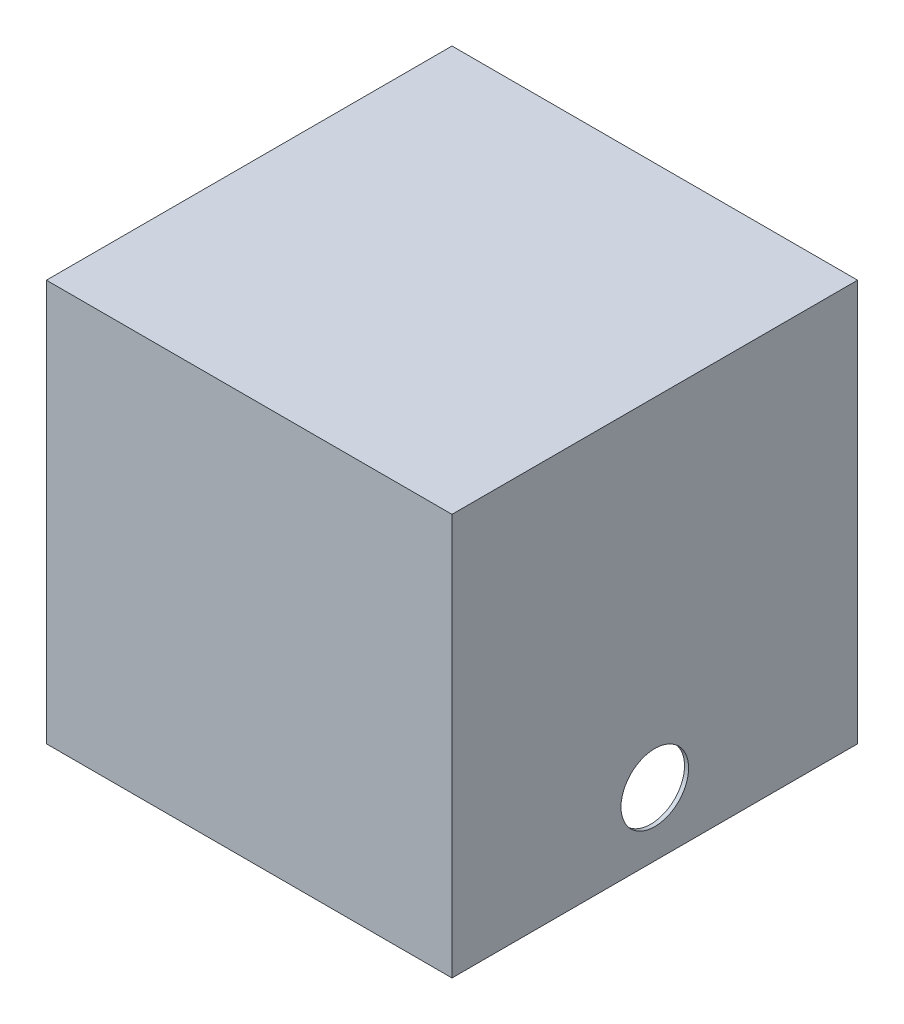
ISO-10303-21;
HEADER;
FILE_DESCRIPTION(('STEP AP214'),'2;1');
FILE_NAME('part.step','',(''),(''),'','','');
FILE_SCHEMA(('AUTOMOTIVE_DESIGN { 1 0 10303 214 1 1 1 1 }'));
ENDSEC;
DATA;
#1=APPLICATION_CONTEXT('core data for automotive mechanical design processes');
#2=APPLICATION_PROTOCOL_DEFINITION('international standard','automotive_design',2000,#1);
#3=PRODUCT_CONTEXT('',#1,'mechanical');
#4=PRODUCT('Part','Part','',(#3));
#5=PRODUCT_RELATED_PRODUCT_CATEGORY('part','',(#4));
#6=PRODUCT_DEFINITION_FORMATION('','',#4);
#7=PRODUCT_DEFINITION_CONTEXT('part definition',#1,'design');
#8=PRODUCT_DEFINITION('design','',#6,#7);
#9=PRODUCT_DEFINITION_SHAPE('','',#8);
#10=(LENGTH_UNIT() NAMED_UNIT(*) SI_UNIT(.MILLI.,.METRE.));
#11=(NAMED_UNIT(*) PLANE_ANGLE_UNIT() SI_UNIT($,.RADIAN.));
#12=(NAMED_UNIT(*) SI_UNIT($,.STERADIAN.) SOLID_ANGLE_UNIT());
#13=UNCERTAINTY_MEASURE_WITH_UNIT(LENGTH_MEASURE(1.E-05),#10,'distance_accuracy_value','');
#14=(GEOMETRIC_REPRESENTATION_CONTEXT(3) GLOBAL_UNCERTAINTY_ASSIGNED_CONTEXT((#13)) GLOBAL_UNIT_ASSIGNED_CONTEXT((#10,
#11,#12)) REPRESENTATION_CONTEXT('',''));
#15=CARTESIAN_POINT('',(0.,0.,0.));
#16=DIRECTION('',(0.,0.,1.));
#17=DIRECTION('',(1.,0.,0.));
#18=AXIS2_PLACEMENT_3D('',#15,#16,#17);
#19=CARTESIAN_POINT('',(0.,297.,0.));
#20=DIRECTION('',(0.,-1.,0.));
#21=DIRECTION('',(0.,0.,-1.));
#22=AXIS2_PLACEMENT_3D('',#19,#20,#21);
#23=PLANE('',#22);
#24=DIRECTION('',(-1.,0.,0.));
#25=VECTOR('',#24,1.);
#26=CARTESIAN_POINT('',(147.,297.,147.));
#27=LINE('',#26,#25);
#28=CARTESIAN_POINT('',(147.,297.,147.));
#29=VERTEX_POINT('',#28);
#30=CARTESIAN_POINT('',(-147.,297.,147.));
#31=VERTEX_POINT('',#30);
#32=EDGE_CURVE('E159',#29,#31,#27,.T.);
#33=ORIENTED_EDGE('',*,*,#32,.T.);
#34=DIRECTION('',(0.,0.,-1.));
#35=VECTOR('',#34,1.);
#36=CARTESIAN_POINT('',(-147.,297.,-147.));
#37=LINE('',#36,#35);
#38=CARTESIAN_POINT('',(-147.,297.,-147.));
#39=VERTEX_POINT('',#38);
#40=EDGE_CURVE('E65',#31,#39,#37,.T.);
#41=ORIENTED_EDGE('',*,*,#40,.T.);
#42=DIRECTION('',(1.,0.,0.));
#43=VECTOR('',#42,1.);
#44=CARTESIAN_POINT('',(147.,297.,-147.));
#45=LINE('',#44,#43);
#46=CARTESIAN_POINT('',(147.,297.,-147.));
#47=VERTEX_POINT('',#46);
#48=EDGE_CURVE('E11',#39,#47,#45,.T.);
#49=ORIENTED_EDGE('',*,*,#48,.T.);
#50=DIRECTION('',(0.,0.,1.));
#51=VECTOR('',#50,1.);
#52=CARTESIAN_POINT('',(147.,297.,-147.));
#53=LINE('',#52,#51);
#54=EDGE_CURVE('E156',#47,#29,#53,.T.);
#55=ORIENTED_EDGE('',*,*,#54,.T.);
#56=EDGE_LOOP('',(#33,#41,#49,#55));
#57=FACE_BOUND('',#56,.T.);
#58=ADVANCED_FACE('F41',(#57),#23,.T.);
#59=CARTESIAN_POINT('',(147.,300.,-147.));
#60=DIRECTION('',(0.,0.,1.));
#61=DIRECTION('',(1.,0.,0.));
#62=AXIS2_PLACEMENT_3D('',#59,#60,#61);
#63=PLANE('',#62);
#64=ORIENTED_EDGE('',*,*,#48,.F.);
#65=DIRECTION('',(0.,-1.,0.));
#66=VECTOR('',#65,1.);
#67=CARTESIAN_POINT('',(-147.,300.,-147.));
#68=LINE('',#67,#66);
#69=CARTESIAN_POINT('',(-147.,3.,-147.));
#70=VERTEX_POINT('',#69);
#71=EDGE_CURVE('E171',#39,#70,#68,.T.);
#72=ORIENTED_EDGE('',*,*,#71,.T.);
#73=DIRECTION('',(-1.,0.,0.));
#74=VECTOR('',#73,1.);
#75=CARTESIAN_POINT('',(147.,3.,-147.));
#76=LINE('',#75,#74);
#77=CARTESIAN_POINT('',(147.,3.,-147.));
#78=VERTEX_POINT('',#77);
#79=EDGE_CURVE('E169',#78,#70,#76,.T.);
#80=ORIENTED_EDGE('',*,*,#79,.F.);
#81=DIRECTION('',(0.,-1.,0.));
#82=VECTOR('',#81,1.);
#83=CARTESIAN_POINT('',(147.,300.,-147.));
#84=LINE('',#83,#82);
#85=EDGE_CURVE('E174',#47,#78,#84,.T.);
#86=ORIENTED_EDGE('',*,*,#85,.F.);
#87=EDGE_LOOP('',(#64,#72,#80,#86));
#88=FACE_BOUND('',#87,.T.);
#89=ADVANCED_FACE('F198',(#88),#63,.T.);
#90=CARTESIAN_POINT('',(147.,300.,-147.));
#91=DIRECTION('',(-1.,0.,0.));
#92=DIRECTION('',(0.,0.,1.));
#93=AXIS2_PLACEMENT_3D('',#90,#91,#92);
#94=PLANE('',#93);
#95=CARTESIAN_POINT('',(147.,50.,0.));
#96=DIRECTION('',(-1.,0.,0.));
#97=DIRECTION('',(0.,0.,1.));
#98=AXIS2_PLACEMENT_3D('',#95,#96,#97);
#99=CIRCLE('',#98,25.);
#100=CARTESIAN_POINT('',(147.,50.,25.));
#101=VERTEX_POINT('',#100);
#102=EDGE_CURVE('E150',#101,#101,#99,.T.);
#103=ORIENTED_EDGE('',*,*,#102,.F.);
#104=EDGE_LOOP('',(#103));
#105=FACE_BOUND('',#104,.T.);
#106=ORIENTED_EDGE('',*,*,#54,.F.);
#107=ORIENTED_EDGE('',*,*,#85,.T.);
#108=DIRECTION('',(0.,0.,-1.));
#109=VECTOR('',#108,1.);
#110=CARTESIAN_POINT('',(147.,3.,-147.));
#111=LINE('',#110,#109);
#112=CARTESIAN_POINT('',(147.,3.,147.));
#113=VERTEX_POINT('',#112);
#114=EDGE_CURVE('E167',#113,#78,#111,.T.);
#115=ORIENTED_EDGE('',*,*,#114,.F.);
#116=DIRECTION('',(0.,-1.,0.));
#117=VECTOR('',#116,1.);
#118=CARTESIAN_POINT('',(147.,300.,147.));
#119=LINE('',#118,#117);
#120=EDGE_CURVE('E177',#29,#113,#119,.T.);
#121=ORIENTED_EDGE('',*,*,#120,.F.);
#122=EDGE_LOOP('',(#106,#107,#115,#121));
#123=FACE_BOUND('',#122,.T.);
#124=ADVANCED_FACE('F205',(#105,#123),#94,.T.);
#125=CARTESIAN_POINT('',(147.,300.,147.));
#126=DIRECTION('',(0.,0.,-1.));
#127=DIRECTION('',(-1.,0.,0.));
#128=AXIS2_PLACEMENT_3D('',#125,#126,#127);
#129=PLANE('',#128);
#130=ORIENTED_EDGE('',*,*,#32,.F.);
#131=ORIENTED_EDGE('',*,*,#120,.T.);
#132=DIRECTION('',(1.,0.,0.));
#133=VECTOR('',#132,1.);
#134=CARTESIAN_POINT('',(147.,3.,147.));
#135=LINE('',#134,#133);
#136=CARTESIAN_POINT('',(-147.,3.,147.));
#137=VERTEX_POINT('',#136);
#138=EDGE_CURVE('E165',#137,#113,#135,.T.);
#139=ORIENTED_EDGE('',*,*,#138,.F.);
#140=DIRECTION('',(0.,-1.,0.));
#141=VECTOR('',#140,1.);
#142=CARTESIAN_POINT('',(-147.,300.,147.));
#143=LINE('',#142,#141);
#144=EDGE_CURVE('E180',#31,#137,#143,.T.);
#145=ORIENTED_EDGE('',*,*,#144,.F.);
#146=EDGE_LOOP('',(#130,#131,#139,#145));
#147=FACE_BOUND('',#146,.T.);
#148=ADVANCED_FACE('F213',(#147),#129,.T.);
#149=CARTESIAN_POINT('',(-147.,300.,-147.));
#150=DIRECTION('',(1.,0.,0.));
#151=DIRECTION('',(0.,0.,-1.));
#152=AXIS2_PLACEMENT_3D('',#149,#150,#151);
#153=PLANE('',#152);
#154=CARTESIAN_POINT('',(-147.,50.,0.));
#155=DIRECTION('',(1.,0.,0.));
#156=DIRECTION('',(0.,0.,-1.));
#157=AXIS2_PLACEMENT_3D('',#154,#155,#156);
#158=CIRCLE('',#157,25.);
#159=CARTESIAN_POINT('',(-147.,50.,-25.));
#160=VERTEX_POINT('',#159);
#161=EDGE_CURVE('E45',#160,#160,#158,.T.);
#162=ORIENTED_EDGE('',*,*,#161,.F.);
#163=EDGE_LOOP('',(#162));
#164=FACE_BOUND('',#163,.T.);
#165=ORIENTED_EDGE('',*,*,#40,.F.);
#166=ORIENTED_EDGE('',*,*,#144,.T.);
#167=DIRECTION('',(0.,0.,1.));
#168=VECTOR('',#167,1.);
#169=CARTESIAN_POINT('',(-147.,3.,-147.));
#170=LINE('',#169,#168);
#171=EDGE_CURVE('E163',#70,#137,#170,.T.);
#172=ORIENTED_EDGE('',*,*,#171,.F.);
#173=ORIENTED_EDGE('',*,*,#71,.F.);
#174=EDGE_LOOP('',(#165,#166,#172,#173));
#175=FACE_BOUND('',#174,.T.);
#176=ADVANCED_FACE('F216',(#164,#175),#153,.T.);
#177=CARTESIAN_POINT('',(-150.,50.,0.));
#178=DIRECTION('',(1.,0.,0.));
#179=DIRECTION('',(0.,0.,-1.));
#180=AXIS2_PLACEMENT_3D('',#177,#178,#179);
#181=CYLINDRICAL_SURFACE('',#180,25.);
#182=ORIENTED_EDGE('',*,*,#161,.T.);
#183=EDGE_LOOP('',(#182));
#184=FACE_BOUND('',#183,.T.);
#185=CARTESIAN_POINT('',(-150.,50.,0.));
#186=DIRECTION('',(1.,0.,0.));
#187=DIRECTION('',(0.,0.,-1.));
#188=AXIS2_PLACEMENT_3D('',#185,#186,#187);
#189=CIRCLE('',#188,25.);
#190=CARTESIAN_POINT('',(-150.,50.,-25.));
#191=VERTEX_POINT('',#190);
#192=EDGE_CURVE('E147',#191,#191,#189,.T.);
#193=ORIENTED_EDGE('',*,*,#192,.F.);
#194=EDGE_LOOP('',(#193));
#195=FACE_BOUND('',#194,.T.);
#196=ADVANCED_FACE('F209',(#184,#195),#181,.F.);
#197=ORIENTED_EDGE('',*,*,#102,.T.);
#198=EDGE_LOOP('',(#197));
#199=FACE_BOUND('',#198,.T.);
#200=CARTESIAN_POINT('',(150.,50.,0.));
#201=DIRECTION('',(-1.,0.,0.));
#202=DIRECTION('',(0.,0.,1.));
#203=AXIS2_PLACEMENT_3D('',#200,#201,#202);
#204=CIRCLE('',#203,25.);
#205=CARTESIAN_POINT('',(150.,50.,25.));
#206=VERTEX_POINT('',#205);
#207=EDGE_CURVE('E153',#206,#206,#204,.T.);
#208=ORIENTED_EDGE('',*,*,#207,.F.);
#209=EDGE_LOOP('',(#208));
#210=FACE_BOUND('',#209,.T.);
#211=ADVANCED_FACE('F223',(#199,#210),#181,.F.);
#212=CARTESIAN_POINT('',(-150.,3.,-150.));
#213=DIRECTION('',(1.,0.,0.));
#214=DIRECTION('',(0.,0.,-1.));
#215=AXIS2_PLACEMENT_3D('',#212,#213,#214);
#216=PLANE('',#215);
#217=ORIENTED_EDGE('',*,*,#192,.T.);
#218=EDGE_LOOP('',(#217));
#219=FACE_BOUND('',#218,.T.);
#220=DIRECTION('',(0.,-1.,0.));
#221=VECTOR('',#220,1.);
#222=CARTESIAN_POINT('',(-150.,3.,-150.));
#223=LINE('',#222,#221);
#224=CARTESIAN_POINT('',(-150.,300.,-150.));
#225=VERTEX_POINT('',#224);
#226=CARTESIAN_POINT('',(-150.,3.,-150.));
#227=VERTEX_POINT('',#226);
#228=EDGE_CURVE('E128',#225,#227,#223,.T.);
#229=ORIENTED_EDGE('',*,*,#228,.T.);
#230=DIRECTION('',(0.,0.,-1.));
#231=VECTOR('',#230,1.);
#232=CARTESIAN_POINT('',(-150.,3.,150.));
#233=LINE('',#232,#231);
#234=CARTESIAN_POINT('',(-150.,3.,150.));
#235=VERTEX_POINT('',#234);
#236=EDGE_CURVE('E57',#235,#227,#233,.T.);
#237=ORIENTED_EDGE('',*,*,#236,.F.);
#238=DIRECTION('',(0.,-1.,0.));
#239=VECTOR('',#238,1.);
#240=CARTESIAN_POINT('',(-150.,3.,150.));
#241=LINE('',#240,#239);
#242=CARTESIAN_POINT('',(-150.,300.,150.));
#243=VERTEX_POINT('',#242);
#244=EDGE_CURVE('E50',#243,#235,#241,.T.);
#245=ORIENTED_EDGE('',*,*,#244,.F.);
#246=DIRECTION('',(0.,0.,1.));
#247=VECTOR('',#246,1.);
#248=CARTESIAN_POINT('',(-150.,300.,-150.));
#249=LINE('',#248,#247);
#250=EDGE_CURVE('E143',#225,#243,#249,.T.);
#251=ORIENTED_EDGE('',*,*,#250,.F.);
#252=EDGE_LOOP('',(#229,#237,#245,#251));
#253=FACE_BOUND('',#252,.T.);
#254=ADVANCED_FACE('F43',(#219,#253),#216,.F.);
#255=CARTESIAN_POINT('',(150.,3.,150.));
#256=DIRECTION('',(0.,0.,-1.));
#257=DIRECTION('',(-1.,0.,0.));
#258=AXIS2_PLACEMENT_3D('',#255,#256,#257);
#259=PLANE('',#258);
#260=ORIENTED_EDGE('',*,*,#244,.T.);
#261=DIRECTION('',(-1.,0.,0.));
#262=VECTOR('',#261,1.);
#263=CARTESIAN_POINT('',(150.,3.,150.));
#264=LINE('',#263,#262);
#265=CARTESIAN_POINT('',(150.,3.,150.));
#266=VERTEX_POINT('',#265);
#267=EDGE_CURVE('E122',#266,#235,#264,.T.);
#268=ORIENTED_EDGE('',*,*,#267,.F.);
#269=DIRECTION('',(0.,-1.,0.));
#270=VECTOR('',#269,1.);
#271=CARTESIAN_POINT('',(150.,3.,150.));
#272=LINE('',#271,#270);
#273=CARTESIAN_POINT('',(150.,300.,150.));
#274=VERTEX_POINT('',#273);
#275=EDGE_CURVE('E121',#274,#266,#272,.T.);
#276=ORIENTED_EDGE('',*,*,#275,.F.);
#277=DIRECTION('',(1.,0.,0.));
#278=VECTOR('',#277,1.);
#279=CARTESIAN_POINT('',(150.,300.,150.));
#280=LINE('',#279,#278);
#281=EDGE_CURVE('E139',#243,#274,#280,.T.);
#282=ORIENTED_EDGE('',*,*,#281,.F.);
#283=EDGE_LOOP('',(#260,#268,#276,#282));
#284=FACE_BOUND('',#283,.T.);
#285=ADVANCED_FACE('F137',(#284),#259,.F.);
#286=CARTESIAN_POINT('',(150.,3.,-150.));
#287=DIRECTION('',(-1.,0.,0.));
#288=DIRECTION('',(0.,0.,1.));
#289=AXIS2_PLACEMENT_3D('',#286,#287,#288);
#290=PLANE('',#289);
#291=ORIENTED_EDGE('',*,*,#207,.T.);
#292=EDGE_LOOP('',(#291));
#293=FACE_BOUND('',#292,.T.);
#294=ORIENTED_EDGE('',*,*,#275,.T.);
#295=DIRECTION('',(0.,0.,1.));
#296=VECTOR('',#295,1.);
#297=CARTESIAN_POINT('',(150.,3.,150.));
#298=LINE('',#297,#296);
#299=CARTESIAN_POINT('',(150.,3.,-150.));
#300=VERTEX_POINT('',#299);
#301=EDGE_CURVE('E109',#300,#266,#298,.T.);
#302=ORIENTED_EDGE('',*,*,#301,.F.);
#303=DIRECTION('',(0.,-1.,0.));
#304=VECTOR('',#303,1.);
#305=CARTESIAN_POINT('',(150.,3.,-150.));
#306=LINE('',#305,#304);
#307=CARTESIAN_POINT('',(150.,300.,-150.));
#308=VERTEX_POINT('',#307);
#309=EDGE_CURVE('E119',#308,#300,#306,.T.);
#310=ORIENTED_EDGE('',*,*,#309,.F.);
#311=DIRECTION('',(0.,0.,-1.));
#312=VECTOR('',#311,1.);
#313=CARTESIAN_POINT('',(150.,300.,-150.));
#314=LINE('',#313,#312);
#315=EDGE_CURVE('E184',#274,#308,#314,.T.);
#316=ORIENTED_EDGE('',*,*,#315,.F.);
#317=EDGE_LOOP('',(#294,#302,#310,#316));
#318=FACE_BOUND('',#317,.T.);
#319=ADVANCED_FACE('F117',(#293,#318),#290,.F.);
#320=CARTESIAN_POINT('',(150.,3.,-150.));
#321=DIRECTION('',(0.,0.,1.));
#322=DIRECTION('',(1.,0.,0.));
#323=AXIS2_PLACEMENT_3D('',#320,#321,#322);
#324=PLANE('',#323);
#325=ORIENTED_EDGE('',*,*,#309,.T.);
#326=DIRECTION('',(1.,0.,0.));
#327=VECTOR('',#326,1.);
#328=CARTESIAN_POINT('',(150.,3.,-150.));
#329=LINE('',#328,#327);
#330=EDGE_CURVE('E106',#227,#300,#329,.T.);
#331=ORIENTED_EDGE('',*,*,#330,.F.);
#332=ORIENTED_EDGE('',*,*,#228,.F.);
#333=DIRECTION('',(-1.,0.,0.));
#334=VECTOR('',#333,1.);
#335=CARTESIAN_POINT('',(150.,300.,-150.));
#336=LINE('',#335,#334);
#337=EDGE_CURVE('E127',#308,#225,#336,.T.);
#338=ORIENTED_EDGE('',*,*,#337,.F.);
#339=EDGE_LOOP('',(#325,#331,#332,#338));
#340=FACE_BOUND('',#339,.T.);
#341=ADVANCED_FACE('F125',(#340),#324,.F.);
#342=CARTESIAN_POINT('',(0.,300.,0.));
#343=DIRECTION('',(0.,-1.,0.));
#344=DIRECTION('',(0.,0.,-1.));
#345=AXIS2_PLACEMENT_3D('',#342,#343,#344);
#346=PLANE('',#345);
#347=ORIENTED_EDGE('',*,*,#250,.T.);
#348=ORIENTED_EDGE('',*,*,#281,.T.);
#349=ORIENTED_EDGE('',*,*,#315,.T.);
#350=ORIENTED_EDGE('',*,*,#337,.T.);
#351=EDGE_LOOP('',(#347,#348,#349,#350));
#352=FACE_BOUND('',#351,.T.);
#353=ADVANCED_FACE('F186',(#352),#346,.F.);
#354=CARTESIAN_POINT('',(0.,3.,0.));
#355=DIRECTION('',(0.,1.,0.));
#356=DIRECTION('',(0.,0.,1.));
#357=AXIS2_PLACEMENT_3D('',#354,#355,#356);
#358=PLANE('',#357);
#359=ORIENTED_EDGE('',*,*,#79,.T.);
#360=ORIENTED_EDGE('',*,*,#171,.T.);
#361=ORIENTED_EDGE('',*,*,#138,.T.);
#362=ORIENTED_EDGE('',*,*,#114,.T.);
#363=EDGE_LOOP('',(#359,#360,#361,#362));
#364=FACE_BOUND('',#363,.T.);
#365=ORIENTED_EDGE('',*,*,#236,.T.);
#366=ORIENTED_EDGE('',*,*,#330,.T.);
#367=ORIENTED_EDGE('',*,*,#301,.T.);
#368=ORIENTED_EDGE('',*,*,#267,.T.);
#369=EDGE_LOOP('',(#365,#366,#367,#368));
#370=FACE_BOUND('',#369,.T.);
#371=ADVANCED_FACE('F108',(#364,#370),#358,.F.);
#372=CLOSED_SHELL('',(#58,#89,#124,#148,#176,#196,#211,#254,#285,#319,#341,#353,#371));
#373=MANIFOLD_SOLID_BREP('B2',#372);
#374=ADVANCED_BREP_SHAPE_REPRESENTATION('',(#18,#373),#14);
#375=SHAPE_DEFINITION_REPRESENTATION(#9,#374);
ENDSEC;
END-ISO-10303-21;
